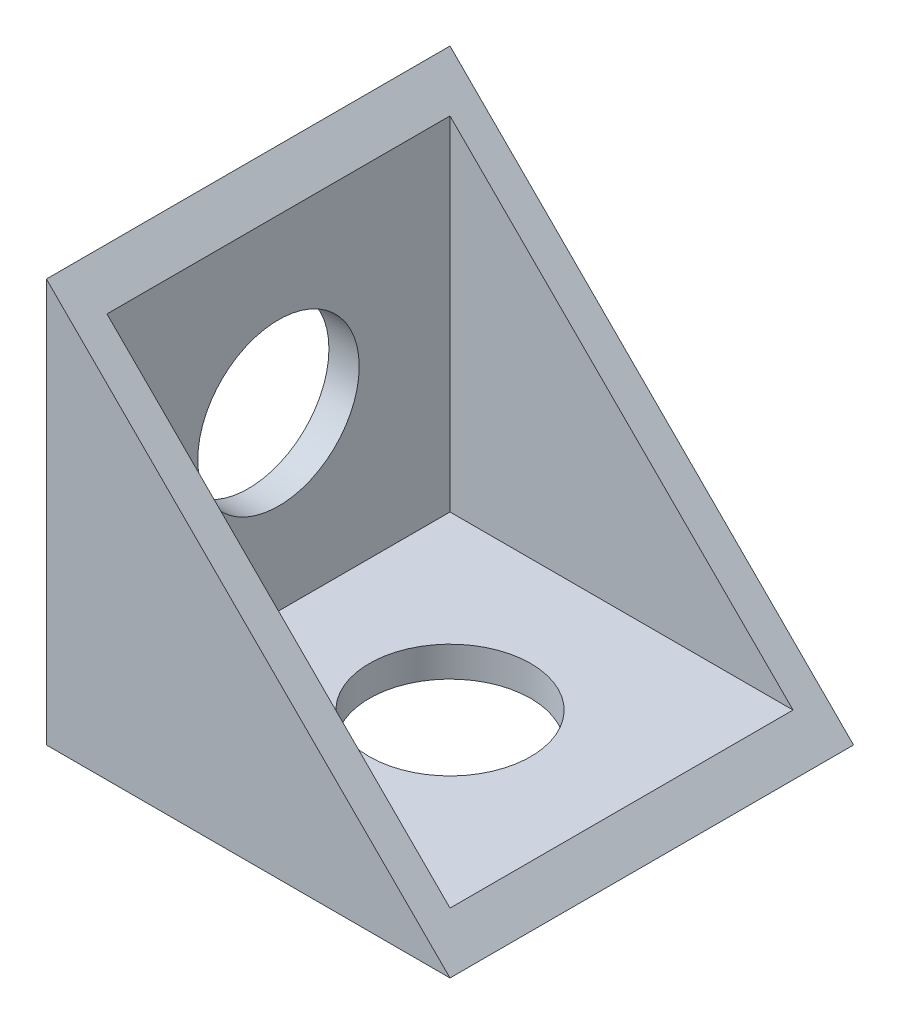
ISO-10303-21;
HEADER;
FILE_DESCRIPTION(('STEP AP214'),'2;1');
FILE_NAME('part.step','',(''),(''),'','','');
FILE_SCHEMA(('AUTOMOTIVE_DESIGN { 1 0 10303 214 1 1 1 1 }'));
ENDSEC;
DATA;
#1=APPLICATION_CONTEXT('core data for automotive mechanical design processes');
#2=APPLICATION_PROTOCOL_DEFINITION('international standard','automotive_design',2000,#1);
#3=PRODUCT_CONTEXT('',#1,'mechanical');
#4=PRODUCT('Part','Part','',(#3));
#5=PRODUCT_RELATED_PRODUCT_CATEGORY('part','',(#4));
#6=PRODUCT_DEFINITION_FORMATION('','',#4);
#7=PRODUCT_DEFINITION_CONTEXT('part definition',#1,'design');
#8=PRODUCT_DEFINITION('design','',#6,#7);
#9=PRODUCT_DEFINITION_SHAPE('','',#8);
#10=(LENGTH_UNIT() NAMED_UNIT(*) SI_UNIT(.MILLI.,.METRE.));
#11=(NAMED_UNIT(*) PLANE_ANGLE_UNIT() SI_UNIT($,.RADIAN.));
#12=(NAMED_UNIT(*) SI_UNIT($,.STERADIAN.) SOLID_ANGLE_UNIT());
#13=UNCERTAINTY_MEASURE_WITH_UNIT(LENGTH_MEASURE(1.E-05),#10,'distance_accuracy_value','');
#14=(GEOMETRIC_REPRESENTATION_CONTEXT(3) GLOBAL_UNCERTAINTY_ASSIGNED_CONTEXT((#13)) GLOBAL_UNIT_ASSIGNED_CONTEXT((#10,
#11,#12)) REPRESENTATION_CONTEXT('',''));
#15=CARTESIAN_POINT('',(0.,0.,0.));
#16=DIRECTION('',(0.,0.,1.));
#17=DIRECTION('',(1.,0.,0.));
#18=AXIS2_PLACEMENT_3D('',#15,#16,#17);
#19=CARTESIAN_POINT('',(10.,0.,10.));
#20=DIRECTION('',(-0.707106781186544,-0.707106781186551,0.));
#21=DIRECTION('',(0.707106781186551,-0.707106781186544,0.));
#22=AXIS2_PLACEMENT_3D('',#19,#20,#21);
#23=PLANE('',#22);
#24=DIRECTION('',(-0.707106781186551,0.707106781186544,0.));
#25=VECTOR('',#24,1.);
#26=CARTESIAN_POINT('',(10.,0.,-10.));
#27=LINE('',#26,#25);
#28=CARTESIAN_POINT('',(10.,0.,-10.));
#29=VERTEX_POINT('',#28);
#30=CARTESIAN_POINT('',(-10.,19.9999999999998,-10.));
#31=VERTEX_POINT('',#30);
#32=EDGE_CURVE('E77',#29,#31,#27,.T.);
#33=ORIENTED_EDGE('',*,*,#32,.T.);
#34=DIRECTION('',(0.,0.,-1.));
#35=VECTOR('',#34,1.);
#36=CARTESIAN_POINT('',(-10.,19.9999999999998,10.));
#37=LINE('',#36,#35);
#38=CARTESIAN_POINT('',(-10.,19.9999999999998,10.));
#39=VERTEX_POINT('',#38);
#40=EDGE_CURVE('E136',#39,#31,#37,.T.);
#41=ORIENTED_EDGE('',*,*,#40,.F.);
#42=DIRECTION('',(-0.707106781186551,0.707106781186544,0.));
#43=VECTOR('',#42,1.);
#44=CARTESIAN_POINT('',(10.,0.,10.));
#45=LINE('',#44,#43);
#46=CARTESIAN_POINT('',(10.,0.,10.));
#47=VERTEX_POINT('',#46);
#48=EDGE_CURVE('E60',#47,#39,#45,.T.);
#49=ORIENTED_EDGE('',*,*,#48,.F.);
#50=DIRECTION('',(0.,0.,-1.));
#51=VECTOR('',#50,1.);
#52=CARTESIAN_POINT('',(10.,0.,10.));
#53=LINE('',#52,#51);
#54=EDGE_CURVE('E143',#47,#29,#53,.T.);
#55=ORIENTED_EDGE('',*,*,#54,.T.);
#56=EDGE_LOOP('',(#33,#41,#49,#55));
#57=FACE_BOUND('',#56,.T.);
#58=DIRECTION('',(0.707106781186551,-0.707106781186544,0.));
#59=VECTOR('',#58,1.);
#60=CARTESIAN_POINT('',(10.,0.,8.5));
#61=LINE('',#60,#59);
#62=CARTESIAN_POINT('',(-8.5,18.4999999999998,8.5));
#63=VERTEX_POINT('',#62);
#64=CARTESIAN_POINT('',(8.49999999999999,1.5,8.5));
#65=VERTEX_POINT('',#64);
#66=EDGE_CURVE('E11',#63,#65,#61,.T.);
#67=ORIENTED_EDGE('',*,*,#66,.F.);
#68=DIRECTION('',(0.,0.,1.));
#69=VECTOR('',#68,1.);
#70=CARTESIAN_POINT('',(-8.5,18.4999999999998,10.));
#71=LINE('',#70,#69);
#72=CARTESIAN_POINT('',(-8.5,18.4999999999998,-8.5));
#73=VERTEX_POINT('',#72);
#74=EDGE_CURVE('E113',#73,#63,#71,.T.);
#75=ORIENTED_EDGE('',*,*,#74,.F.);
#76=DIRECTION('',(-0.707106781186551,0.707106781186544,0.));
#77=VECTOR('',#76,1.);
#78=CARTESIAN_POINT('',(10.,0.,-8.50000000000001));
#79=LINE('',#78,#77);
#80=CARTESIAN_POINT('',(8.49999999999999,1.5,-8.50000000000001));
#81=VERTEX_POINT('',#80);
#82=EDGE_CURVE('E44',#81,#73,#79,.T.);
#83=ORIENTED_EDGE('',*,*,#82,.F.);
#84=DIRECTION('',(0.,0.,-1.));
#85=VECTOR('',#84,1.);
#86=CARTESIAN_POINT('',(8.49999999999999,1.5,10.));
#87=LINE('',#86,#85);
#88=EDGE_CURVE('E123',#65,#81,#87,.T.);
#89=ORIENTED_EDGE('',*,*,#88,.F.);
#90=EDGE_LOOP('',(#67,#75,#83,#89));
#91=FACE_BOUND('',#90,.T.);
#92=ADVANCED_FACE('F36',(#57,#91),#23,.F.);
#93=CARTESIAN_POINT('',(0.,20.,0.));
#94=DIRECTION('',(0.,-1.,0.));
#95=DIRECTION('',(0.,0.,-1.));
#96=AXIS2_PLACEMENT_3D('',#93,#94,#95);
#97=CYLINDRICAL_SURFACE('',#96,4.);
#98=CARTESIAN_POINT('',(0.,0.,0.));
#99=DIRECTION('',(0.,1.,0.));
#100=DIRECTION('',(0.,0.,1.));
#101=AXIS2_PLACEMENT_3D('',#98,#99,#100);
#102=CIRCLE('',#101,4.);
#103=CARTESIAN_POINT('',(0.,0.,4.));
#104=VERTEX_POINT('',#103);
#105=EDGE_CURVE('E128',#104,#104,#102,.T.);
#106=ORIENTED_EDGE('',*,*,#105,.F.);
#107=EDGE_LOOP('',(#106));
#108=FACE_BOUND('',#107,.T.);
#109=CARTESIAN_POINT('',(0.,1.5,0.));
#110=DIRECTION('',(0.,1.,0.));
#111=DIRECTION('',(0.,0.,1.));
#112=AXIS2_PLACEMENT_3D('',#109,#110,#111);
#113=CIRCLE('',#112,4.);
#114=CARTESIAN_POINT('',(0.,1.5,4.));
#115=VERTEX_POINT('',#114);
#116=EDGE_CURVE('E122',#115,#115,#113,.T.);
#117=ORIENTED_EDGE('',*,*,#116,.T.);
#118=EDGE_LOOP('',(#117));
#119=FACE_BOUND('',#118,.T.);
#120=ADVANCED_FACE('F155',(#108,#119),#97,.F.);
#121=CARTESIAN_POINT('',(-10.,9.9999999999999,0.));
#122=DIRECTION('',(1.,0.,0.));
#123=DIRECTION('',(0.,0.,-1.));
#124=AXIS2_PLACEMENT_3D('',#121,#122,#123);
#125=CYLINDRICAL_SURFACE('',#124,4.);
#126=CARTESIAN_POINT('',(-10.,9.9999999999999,0.));
#127=DIRECTION('',(1.,0.,0.));
#128=DIRECTION('',(0.,0.,-1.));
#129=AXIS2_PLACEMENT_3D('',#126,#127,#128);
#130=CIRCLE('',#129,4.);
#131=CARTESIAN_POINT('',(-10.,9.9999999999999,-4.));
#132=VERTEX_POINT('',#131);
#133=EDGE_CURVE('E125',#132,#132,#130,.T.);
#134=ORIENTED_EDGE('',*,*,#133,.F.);
#135=EDGE_LOOP('',(#134));
#136=FACE_BOUND('',#135,.T.);
#137=CARTESIAN_POINT('',(-8.5,9.9999999999999,0.));
#138=DIRECTION('',(1.,0.,0.));
#139=DIRECTION('',(0.,0.,-1.));
#140=AXIS2_PLACEMENT_3D('',#137,#138,#139);
#141=CIRCLE('',#140,4.);
#142=CARTESIAN_POINT('',(-8.5,9.9999999999999,-4.));
#143=VERTEX_POINT('',#142);
#144=EDGE_CURVE('E107',#143,#143,#141,.F.);
#145=ORIENTED_EDGE('',*,*,#144,.F.);
#146=EDGE_LOOP('',(#145));
#147=FACE_BOUND('',#146,.T.);
#148=ADVANCED_FACE('F160',(#136,#147),#125,.F.);
#149=CARTESIAN_POINT('',(-10.,19.9999999999998,10.));
#150=DIRECTION('',(1.,0.,0.));
#151=DIRECTION('',(0.,1.,0.));
#152=AXIS2_PLACEMENT_3D('',#149,#150,#151);
#153=PLANE('',#152);
#154=ORIENTED_EDGE('',*,*,#133,.T.);
#155=EDGE_LOOP('',(#154));
#156=FACE_BOUND('',#155,.T.);
#157=DIRECTION('',(0.,-1.,0.));
#158=VECTOR('',#157,1.);
#159=CARTESIAN_POINT('',(-10.,19.9999999999998,-10.));
#160=LINE('',#159,#158);
#161=CARTESIAN_POINT('',(-10.,0.,-10.));
#162=VERTEX_POINT('',#161);
#163=EDGE_CURVE('E131',#31,#162,#160,.T.);
#164=ORIENTED_EDGE('',*,*,#163,.T.);
#165=DIRECTION('',(0.,0.,-1.));
#166=VECTOR('',#165,1.);
#167=CARTESIAN_POINT('',(-10.,0.,10.));
#168=LINE('',#167,#166);
#169=CARTESIAN_POINT('',(-10.,0.,10.));
#170=VERTEX_POINT('',#169);
#171=EDGE_CURVE('E145',#170,#162,#168,.T.);
#172=ORIENTED_EDGE('',*,*,#171,.F.);
#173=DIRECTION('',(0.,-1.,0.));
#174=VECTOR('',#173,1.);
#175=CARTESIAN_POINT('',(-10.,19.9999999999998,10.));
#176=LINE('',#175,#174);
#177=EDGE_CURVE('E132',#39,#170,#176,.T.);
#178=ORIENTED_EDGE('',*,*,#177,.F.);
#179=ORIENTED_EDGE('',*,*,#40,.T.);
#180=EDGE_LOOP('',(#164,#172,#178,#179));
#181=FACE_BOUND('',#180,.T.);
#182=ADVANCED_FACE('F38',(#156,#181),#153,.F.);
#183=CARTESIAN_POINT('',(-10.,0.,10.));
#184=DIRECTION('',(0.,1.,0.));
#185=DIRECTION('',(0.,0.,1.));
#186=AXIS2_PLACEMENT_3D('',#183,#184,#185);
#187=PLANE('',#186);
#188=ORIENTED_EDGE('',*,*,#105,.T.);
#189=EDGE_LOOP('',(#188));
#190=FACE_BOUND('',#189,.T.);
#191=DIRECTION('',(1.,0.,0.));
#192=VECTOR('',#191,1.);
#193=CARTESIAN_POINT('',(-10.,0.,-10.));
#194=LINE('',#193,#192);
#195=EDGE_CURVE('E139',#162,#29,#194,.T.);
#196=ORIENTED_EDGE('',*,*,#195,.T.);
#197=ORIENTED_EDGE('',*,*,#54,.F.);
#198=DIRECTION('',(1.,0.,0.));
#199=VECTOR('',#198,1.);
#200=CARTESIAN_POINT('',(-10.,0.,10.));
#201=LINE('',#200,#199);
#202=EDGE_CURVE('E83',#170,#47,#201,.T.);
#203=ORIENTED_EDGE('',*,*,#202,.F.);
#204=ORIENTED_EDGE('',*,*,#171,.T.);
#205=EDGE_LOOP('',(#196,#197,#203,#204));
#206=FACE_BOUND('',#205,.T.);
#207=ADVANCED_FACE('F166',(#190,#206),#187,.F.);
#208=CARTESIAN_POINT('',(0.,0.,10.));
#209=DIRECTION('',(0.,0.,1.));
#210=DIRECTION('',(1.,0.,0.));
#211=AXIS2_PLACEMENT_3D('',#208,#209,#210);
#212=PLANE('',#211);
#213=ORIENTED_EDGE('',*,*,#177,.T.);
#214=ORIENTED_EDGE('',*,*,#202,.T.);
#215=ORIENTED_EDGE('',*,*,#48,.T.);
#216=EDGE_LOOP('',(#213,#214,#215));
#217=FACE_BOUND('',#216,.T.);
#218=ADVANCED_FACE('F168',(#217),#212,.T.);
#219=CARTESIAN_POINT('',(0.,0.,-10.));
#220=DIRECTION('',(0.,0.,1.));
#221=DIRECTION('',(1.,0.,0.));
#222=AXIS2_PLACEMENT_3D('',#219,#220,#221);
#223=PLANE('',#222);
#224=ORIENTED_EDGE('',*,*,#163,.F.);
#225=ORIENTED_EDGE('',*,*,#32,.F.);
#226=ORIENTED_EDGE('',*,*,#195,.F.);
#227=EDGE_LOOP('',(#224,#225,#226));
#228=FACE_BOUND('',#227,.T.);
#229=ADVANCED_FACE('F164',(#228),#223,.F.);
#230=CARTESIAN_POINT('',(10.,19.9999999999998,8.5));
#231=DIRECTION('',(0.,0.,-1.));
#232=DIRECTION('',(0.,1.,0.));
#233=AXIS2_PLACEMENT_3D('',#230,#231,#232);
#234=PLANE('',#233);
#235=ORIENTED_EDGE('',*,*,#66,.T.);
#236=DIRECTION('',(-1.,0.,0.));
#237=VECTOR('',#236,1.);
#238=CARTESIAN_POINT('',(10.,1.5,8.5));
#239=LINE('',#238,#237);
#240=CARTESIAN_POINT('',(-8.5,1.5,8.5));
#241=VERTEX_POINT('',#240);
#242=EDGE_CURVE('E99',#65,#241,#239,.T.);
#243=ORIENTED_EDGE('',*,*,#242,.T.);
#244=DIRECTION('',(0.,-1.,0.));
#245=VECTOR('',#244,1.);
#246=CARTESIAN_POINT('',(-8.5,19.9999999999998,8.5));
#247=LINE('',#246,#245);
#248=EDGE_CURVE('E102',#63,#241,#247,.T.);
#249=ORIENTED_EDGE('',*,*,#248,.F.);
#250=EDGE_LOOP('',(#235,#243,#249));
#251=FACE_BOUND('',#250,.T.);
#252=ADVANCED_FACE('F101',(#251),#234,.T.);
#253=CARTESIAN_POINT('',(10.,19.9999999999998,-8.5));
#254=DIRECTION('',(0.,0.,1.));
#255=DIRECTION('',(0.,-1.,0.));
#256=AXIS2_PLACEMENT_3D('',#253,#254,#255);
#257=PLANE('',#256);
#258=ORIENTED_EDGE('',*,*,#82,.T.);
#259=DIRECTION('',(0.,1.,0.));
#260=VECTOR('',#259,1.);
#261=CARTESIAN_POINT('',(-8.5,19.9999999999998,-8.5));
#262=LINE('',#261,#260);
#263=CARTESIAN_POINT('',(-8.5,1.5,-8.50000000000001));
#264=VERTEX_POINT('',#263);
#265=EDGE_CURVE('E51',#264,#73,#262,.T.);
#266=ORIENTED_EDGE('',*,*,#265,.F.);
#267=DIRECTION('',(-1.,0.,0.));
#268=VECTOR('',#267,1.);
#269=CARTESIAN_POINT('',(10.,1.5,-8.50000000000001));
#270=LINE('',#269,#268);
#271=EDGE_CURVE('E108',#81,#264,#270,.T.);
#272=ORIENTED_EDGE('',*,*,#271,.F.);
#273=EDGE_LOOP('',(#258,#266,#272));
#274=FACE_BOUND('',#273,.T.);
#275=ADVANCED_FACE('F152',(#274),#257,.T.);
#276=CARTESIAN_POINT('',(10.,1.5,8.5));
#277=DIRECTION('',(0.,1.,0.));
#278=DIRECTION('',(0.,0.,1.));
#279=AXIS2_PLACEMENT_3D('',#276,#277,#278);
#280=PLANE('',#279);
#281=ORIENTED_EDGE('',*,*,#116,.F.);
#282=EDGE_LOOP('',(#281));
#283=FACE_BOUND('',#282,.T.);
#284=ORIENTED_EDGE('',*,*,#88,.T.);
#285=ORIENTED_EDGE('',*,*,#271,.T.);
#286=DIRECTION('',(0.,0.,-1.));
#287=VECTOR('',#286,1.);
#288=CARTESIAN_POINT('',(-8.5,1.5,8.5));
#289=LINE('',#288,#287);
#290=EDGE_CURVE('E111',#241,#264,#289,.T.);
#291=ORIENTED_EDGE('',*,*,#290,.F.);
#292=ORIENTED_EDGE('',*,*,#242,.F.);
#293=EDGE_LOOP('',(#284,#285,#291,#292));
#294=FACE_BOUND('',#293,.T.);
#295=ADVANCED_FACE('F115',(#283,#294),#280,.T.);
#296=CARTESIAN_POINT('',(-8.5,0.,0.));
#297=DIRECTION('',(1.,0.,0.));
#298=DIRECTION('',(0.,0.,-1.));
#299=AXIS2_PLACEMENT_3D('',#296,#297,#298);
#300=PLANE('',#299);
#301=ORIENTED_EDGE('',*,*,#144,.T.);
#302=EDGE_LOOP('',(#301));
#303=FACE_BOUND('',#302,.T.);
#304=ORIENTED_EDGE('',*,*,#74,.T.);
#305=ORIENTED_EDGE('',*,*,#248,.T.);
#306=ORIENTED_EDGE('',*,*,#290,.T.);
#307=ORIENTED_EDGE('',*,*,#265,.T.);
#308=EDGE_LOOP('',(#304,#305,#306,#307));
#309=FACE_BOUND('',#308,.T.);
#310=ADVANCED_FACE('F110',(#303,#309),#300,.T.);
#311=CLOSED_SHELL('',(#92,#120,#148,#182,#207,#218,#229,#252,#275,#295,#310));
#312=MANIFOLD_SOLID_BREP('B2',#311);
#313=ADVANCED_BREP_SHAPE_REPRESENTATION('',(#18,#312),#14);
#314=SHAPE_DEFINITION_REPRESENTATION(#9,#313);
ENDSEC;
END-ISO-10303-21;
